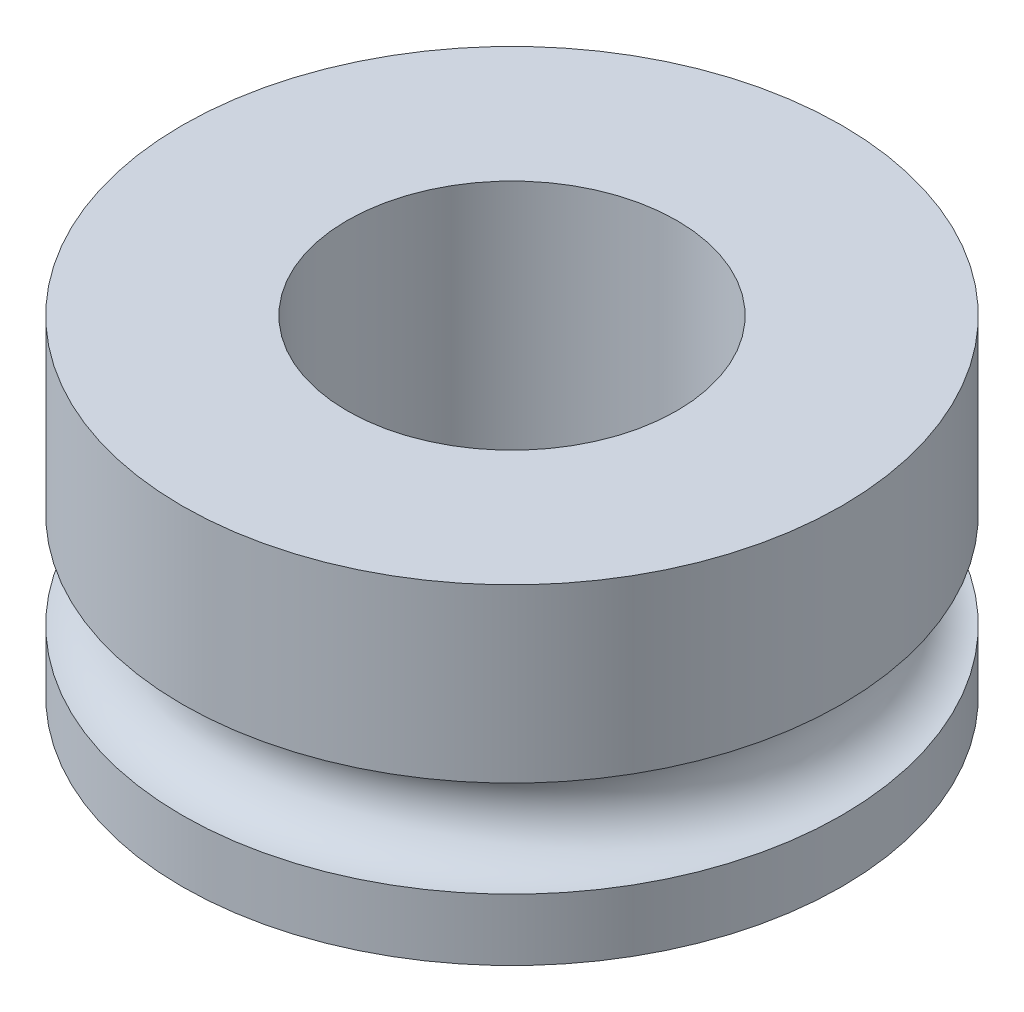
ISO-10303-21;
HEADER;
FILE_DESCRIPTION(('STEP AP214'),'2;1');
FILE_NAME('part.step','',(''),(''),'','','');
FILE_SCHEMA(('AUTOMOTIVE_DESIGN { 1 0 10303 214 1 1 1 1 }'));
ENDSEC;
DATA;
#1=APPLICATION_CONTEXT('core data for automotive mechanical design processes');
#2=APPLICATION_PROTOCOL_DEFINITION('international standard','automotive_design',2000,#1);
#3=PRODUCT_CONTEXT('',#1,'mechanical');
#4=PRODUCT('Part','Part','',(#3));
#5=PRODUCT_RELATED_PRODUCT_CATEGORY('part','',(#4));
#6=PRODUCT_DEFINITION_FORMATION('','',#4);
#7=PRODUCT_DEFINITION_CONTEXT('part definition',#1,'design');
#8=PRODUCT_DEFINITION('design','',#6,#7);
#9=PRODUCT_DEFINITION_SHAPE('','',#8);
#10=(LENGTH_UNIT() NAMED_UNIT(*) SI_UNIT(.MILLI.,.METRE.));
#11=(NAMED_UNIT(*) PLANE_ANGLE_UNIT() SI_UNIT($,.RADIAN.));
#12=(NAMED_UNIT(*) SI_UNIT($,.STERADIAN.) SOLID_ANGLE_UNIT());
#13=UNCERTAINTY_MEASURE_WITH_UNIT(LENGTH_MEASURE(1.E-05),#10,'distance_accuracy_value','');
#14=(GEOMETRIC_REPRESENTATION_CONTEXT(3) GLOBAL_UNCERTAINTY_ASSIGNED_CONTEXT((#13)) GLOBAL_UNIT_ASSIGNED_CONTEXT((#10,
#11,#12)) REPRESENTATION_CONTEXT('',''));
#15=CARTESIAN_POINT('',(0.,0.,0.));
#16=DIRECTION('',(0.,0.,1.));
#17=DIRECTION('',(1.,0.,0.));
#18=AXIS2_PLACEMENT_3D('',#15,#16,#17);
#19=CARTESIAN_POINT('',(0.,6.,0.));
#20=DIRECTION('',(0.,-1.,0.));
#21=DIRECTION('',(0.,0.,-1.));
#22=AXIS2_PLACEMENT_3D('',#19,#20,#21);
#23=CYLINDRICAL_SURFACE('',#22,6.);
#24=CARTESIAN_POINT('',(0.,1.125,0.));
#25=DIRECTION('',(0.,1.,0.));
#26=DIRECTION('',(-1.,0.,0.));
#27=AXIS2_PLACEMENT_3D('',#24,#25,#26);
#28=CIRCLE('',#27,6.);
#29=CARTESIAN_POINT('',(-6.,1.125,0.));
#30=VERTEX_POINT('',#29);
#31=EDGE_CURVE('E47',#30,#30,#28,.F.);
#32=ORIENTED_EDGE('',*,*,#31,.T.);
#33=EDGE_LOOP('',(#32));
#34=FACE_BOUND('',#33,.T.);
#35=CARTESIAN_POINT('',(0.,0.,0.));
#36=DIRECTION('',(0.,1.,0.));
#37=DIRECTION('',(0.,0.,1.));
#38=AXIS2_PLACEMENT_3D('',#35,#36,#37);
#39=CIRCLE('',#38,6.);
#40=CARTESIAN_POINT('',(0.,0.,6.));
#41=VERTEX_POINT('',#40);
#42=EDGE_CURVE('E51',#41,#41,#39,.T.);
#43=ORIENTED_EDGE('',*,*,#42,.T.);
#44=EDGE_LOOP('',(#43));
#45=FACE_BOUND('',#44,.T.);
#46=ADVANCED_FACE('F43',(#34,#45),#23,.T.);
#47=CARTESIAN_POINT('',(0.,0.,0.));
#48=DIRECTION('',(0.,1.,0.));
#49=DIRECTION('',(0.,0.,1.));
#50=AXIS2_PLACEMENT_3D('',#47,#48,#49);
#51=PLANE('',#50);
#52=CARTESIAN_POINT('',(0.,0.,0.));
#53=DIRECTION('',(0.,1.,0.));
#54=DIRECTION('',(0.,0.,1.));
#55=AXIS2_PLACEMENT_3D('',#52,#53,#54);
#56=CIRCLE('',#55,3.00000197611386);
#57=CARTESIAN_POINT('',(0.,0.,3.00000197611386));
#58=VERTEX_POINT('',#57);
#59=EDGE_CURVE('E58',#58,#58,#56,.T.);
#60=ORIENTED_EDGE('',*,*,#59,.T.);
#61=EDGE_LOOP('',(#60));
#62=FACE_BOUND('',#61,.T.);
#63=ORIENTED_EDGE('',*,*,#42,.F.);
#64=EDGE_LOOP('',(#63));
#65=FACE_BOUND('',#64,.T.);
#66=ADVANCED_FACE('F83',(#62,#65),#51,.F.);
#67=CARTESIAN_POINT('',(0.,2.,0.));
#68=DIRECTION('',(0.,-1.,0.));
#69=DIRECTION('',(1.,0.,0.));
#70=AXIS2_PLACEMENT_3D('',#67,#68,#69);
#71=TOROIDAL_SURFACE('',#70,6.,0.875);
#72=CARTESIAN_POINT('',(0.,2.875,0.));
#73=DIRECTION('',(0.,-1.,0.));
#74=DIRECTION('',(1.,0.,0.));
#75=AXIS2_PLACEMENT_3D('',#72,#73,#74);
#76=CIRCLE('',#75,6.);
#77=CARTESIAN_POINT('',(6.,2.875,0.));
#78=VERTEX_POINT('',#77);
#79=EDGE_CURVE('E60',#78,#78,#76,.F.);
#80=ORIENTED_EDGE('',*,*,#79,.F.);
#81=EDGE_LOOP('',(#80));
#82=FACE_BOUND('',#81,.T.);
#83=ORIENTED_EDGE('',*,*,#31,.F.);
#84=EDGE_LOOP('',(#83));
#85=FACE_BOUND('',#84,.T.);
#86=ADVANCED_FACE('F77',(#82,#85),#71,.F.);
#87=CARTESIAN_POINT('',(0.,6.,0.));
#88=DIRECTION('',(0.,1.,0.));
#89=DIRECTION('',(0.,0.,1.));
#90=AXIS2_PLACEMENT_3D('',#87,#88,#89);
#91=PLANE('',#90);
#92=CARTESIAN_POINT('',(0.,6.,0.));
#93=DIRECTION('',(0.,1.,0.));
#94=DIRECTION('',(0.,0.,1.));
#95=AXIS2_PLACEMENT_3D('',#92,#93,#94);
#96=CIRCLE('',#95,3.00000197611386);
#97=CARTESIAN_POINT('',(0.,6.,3.00000197611386));
#98=VERTEX_POINT('',#97);
#99=EDGE_CURVE('E66',#98,#98,#96,.T.);
#100=ORIENTED_EDGE('',*,*,#99,.F.);
#101=EDGE_LOOP('',(#100));
#102=FACE_BOUND('',#101,.T.);
#103=CARTESIAN_POINT('',(0.,6.,0.));
#104=DIRECTION('',(0.,1.,0.));
#105=DIRECTION('',(0.,0.,1.));
#106=AXIS2_PLACEMENT_3D('',#103,#104,#105);
#107=CIRCLE('',#106,6.);
#108=CARTESIAN_POINT('',(0.,6.,6.));
#109=VERTEX_POINT('',#108);
#110=EDGE_CURVE('E12',#109,#109,#107,.T.);
#111=ORIENTED_EDGE('',*,*,#110,.T.);
#112=EDGE_LOOP('',(#111));
#113=FACE_BOUND('',#112,.T.);
#114=ADVANCED_FACE('F75',(#102,#113),#91,.T.);
#115=ORIENTED_EDGE('',*,*,#79,.T.);
#116=EDGE_LOOP('',(#115));
#117=FACE_BOUND('',#116,.T.);
#118=ORIENTED_EDGE('',*,*,#110,.F.);
#119=EDGE_LOOP('',(#118));
#120=FACE_BOUND('',#119,.T.);
#121=ADVANCED_FACE('F45',(#117,#120),#23,.T.);
#122=CARTESIAN_POINT('',(0.,-2.,0.));
#123=DIRECTION('',(0.,1.,0.));
#124=DIRECTION('',(0.,0.,1.));
#125=AXIS2_PLACEMENT_3D('',#122,#123,#124);
#126=CYLINDRICAL_SURFACE('',#125,3.00000197611386);
#127=ORIENTED_EDGE('',*,*,#99,.T.);
#128=EDGE_LOOP('',(#127));
#129=FACE_BOUND('',#128,.T.);
#130=ORIENTED_EDGE('',*,*,#59,.F.);
#131=EDGE_LOOP('',(#130));
#132=FACE_BOUND('',#131,.T.);
#133=ADVANCED_FACE('F72',(#129,#132),#126,.F.);
#134=CLOSED_SHELL('',(#46,#66,#86,#114,#121,#133));
#135=MANIFOLD_SOLID_BREP('B2',#134);
#136=ADVANCED_BREP_SHAPE_REPRESENTATION('',(#18,#135),#14);
#137=SHAPE_DEFINITION_REPRESENTATION(#9,#136);
ENDSEC;
END-ISO-10303-21;
